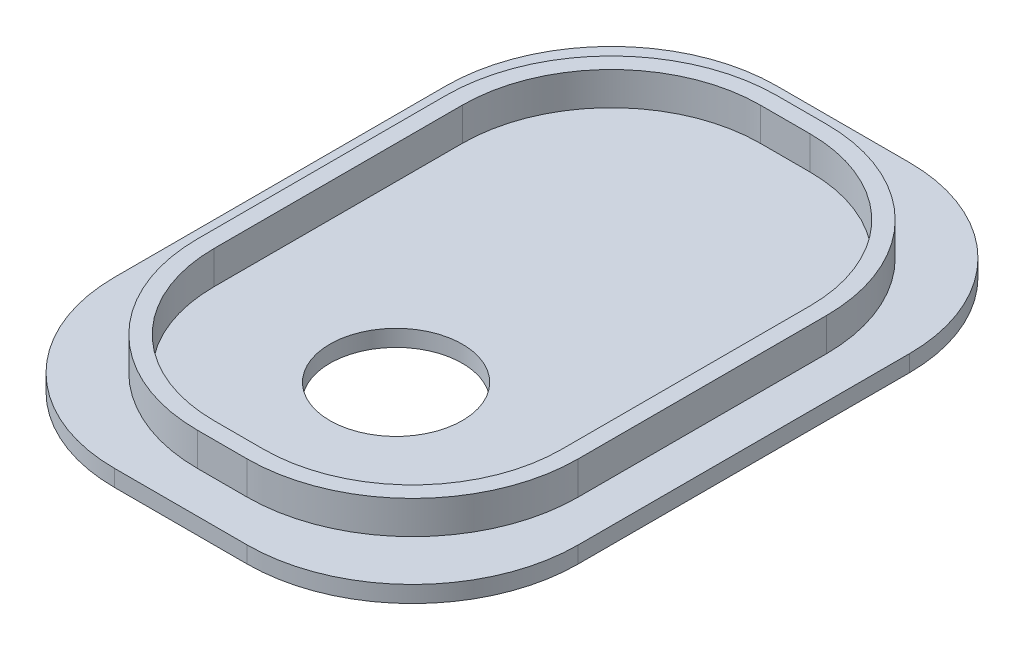
ISO-10303-21;
HEADER;
FILE_DESCRIPTION(('STEP AP214'),'2;1');
FILE_NAME('part.step','',(''),(''),'','','');
FILE_SCHEMA(('AUTOMOTIVE_DESIGN { 1 0 10303 214 1 1 1 1 }'));
ENDSEC;
DATA;
#1=APPLICATION_CONTEXT('core data for automotive mechanical design processes');
#2=APPLICATION_PROTOCOL_DEFINITION('international standard','automotive_design',2000,#1);
#3=PRODUCT_CONTEXT('',#1,'mechanical');
#4=PRODUCT('Part','Part','',(#3));
#5=PRODUCT_RELATED_PRODUCT_CATEGORY('part','',(#4));
#6=PRODUCT_DEFINITION_FORMATION('','',#4);
#7=PRODUCT_DEFINITION_CONTEXT('part definition',#1,'design');
#8=PRODUCT_DEFINITION('design','',#6,#7);
#9=PRODUCT_DEFINITION_SHAPE('','',#8);
#10=(LENGTH_UNIT() NAMED_UNIT(*) SI_UNIT(.MILLI.,.METRE.));
#11=(NAMED_UNIT(*) PLANE_ANGLE_UNIT() SI_UNIT($,.RADIAN.));
#12=(NAMED_UNIT(*) SI_UNIT($,.STERADIAN.) SOLID_ANGLE_UNIT());
#13=UNCERTAINTY_MEASURE_WITH_UNIT(LENGTH_MEASURE(1.E-05),#10,'distance_accuracy_value','');
#14=(GEOMETRIC_REPRESENTATION_CONTEXT(3) GLOBAL_UNCERTAINTY_ASSIGNED_CONTEXT((#13)) GLOBAL_UNIT_ASSIGNED_CONTEXT((#10,
#11,#12)) REPRESENTATION_CONTEXT('',''));
#15=CARTESIAN_POINT('',(0.,0.,0.));
#16=DIRECTION('',(0.,0.,1.));
#17=DIRECTION('',(1.,0.,0.));
#18=AXIS2_PLACEMENT_3D('',#15,#16,#17);
#19=CARTESIAN_POINT('',(-11.5,2.,0.));
#20=DIRECTION('',(1.,0.,0.));
#21=DIRECTION('',(0.,0.,-1.));
#22=AXIS2_PLACEMENT_3D('',#19,#20,#21);
#23=PLANE('',#22);
#24=DIRECTION('',(0.,0.,1.));
#25=VECTOR('',#24,1.);
#26=CARTESIAN_POINT('',(-11.5,0.,0.));
#27=LINE('',#26,#25);
#28=CARTESIAN_POINT('',(-11.5,0.,-14.5));
#29=VERTEX_POINT('',#28);
#30=CARTESIAN_POINT('',(-11.5,0.,0.5));
#31=VERTEX_POINT('',#30);
#32=EDGE_CURVE('E172',#29,#31,#27,.T.);
#33=ORIENTED_EDGE('',*,*,#32,.T.);
#34=DIRECTION('',(0.,-1.,0.));
#35=VECTOR('',#34,1.);
#36=CARTESIAN_POINT('',(-11.5,2.,0.5));
#37=LINE('',#36,#35);
#38=CARTESIAN_POINT('',(-11.5,2.,0.5));
#39=VERTEX_POINT('',#38);
#40=EDGE_CURVE('E11',#39,#31,#37,.T.);
#41=ORIENTED_EDGE('',*,*,#40,.F.);
#42=DIRECTION('',(0.,0.,1.));
#43=VECTOR('',#42,1.);
#44=CARTESIAN_POINT('',(-11.5,2.,0.));
#45=LINE('',#44,#43);
#46=CARTESIAN_POINT('',(-11.5,2.,-14.5));
#47=VERTEX_POINT('',#46);
#48=EDGE_CURVE('E422',#47,#39,#45,.T.);
#49=ORIENTED_EDGE('',*,*,#48,.F.);
#50=DIRECTION('',(0.,-1.,0.));
#51=VECTOR('',#50,1.);
#52=CARTESIAN_POINT('',(-11.5,2.,-14.5));
#53=LINE('',#52,#51);
#54=EDGE_CURVE('E195',#47,#29,#53,.T.);
#55=ORIENTED_EDGE('',*,*,#54,.T.);
#56=EDGE_LOOP('',(#33,#41,#49,#55));
#57=FACE_BOUND('',#56,.T.);
#58=ADVANCED_FACE('F36',(#57),#23,.F.);
#59=CARTESIAN_POINT('',(-1.5,2.,0.5));
#60=DIRECTION('',(0.,-1.,0.));
#61=DIRECTION('',(0.,0.,-1.));
#62=AXIS2_PLACEMENT_3D('',#59,#60,#61);
#63=CYLINDRICAL_SURFACE('',#62,10.);
#64=CARTESIAN_POINT('',(-1.5,0.,0.5));
#65=DIRECTION('',(0.,1.,0.));
#66=DIRECTION('',(0.,0.,1.));
#67=AXIS2_PLACEMENT_3D('',#64,#65,#66);
#68=CIRCLE('',#67,10.);
#69=CARTESIAN_POINT('',(-1.5,0.,10.5));
#70=VERTEX_POINT('',#69);
#71=EDGE_CURVE('E175',#31,#70,#68,.T.);
#72=ORIENTED_EDGE('',*,*,#71,.T.);
#73=DIRECTION('',(0.,-1.,0.));
#74=VECTOR('',#73,1.);
#75=CARTESIAN_POINT('',(-1.5,2.,10.5));
#76=LINE('',#75,#74);
#77=CARTESIAN_POINT('',(-1.5,2.,10.5));
#78=VERTEX_POINT('',#77);
#79=EDGE_CURVE('E46',#78,#70,#76,.T.);
#80=ORIENTED_EDGE('',*,*,#79,.F.);
#81=CARTESIAN_POINT('',(-1.5,2.,0.5));
#82=DIRECTION('',(0.,1.,0.));
#83=DIRECTION('',(0.,0.,1.));
#84=AXIS2_PLACEMENT_3D('',#81,#82,#83);
#85=CIRCLE('',#84,10.);
#86=EDGE_CURVE('E424',#39,#78,#85,.T.);
#87=ORIENTED_EDGE('',*,*,#86,.F.);
#88=ORIENTED_EDGE('',*,*,#40,.T.);
#89=EDGE_LOOP('',(#72,#80,#87,#88));
#90=FACE_BOUND('',#89,.T.);
#91=ADVANCED_FACE('F445',(#90),#63,.T.);
#92=CARTESIAN_POINT('',(0.,2.,10.5));
#93=DIRECTION('',(0.,0.,-1.));
#94=DIRECTION('',(-1.,0.,0.));
#95=AXIS2_PLACEMENT_3D('',#92,#93,#94);
#96=PLANE('',#95);
#97=DIRECTION('',(1.,0.,0.));
#98=VECTOR('',#97,1.);
#99=CARTESIAN_POINT('',(0.,0.,10.5));
#100=LINE('',#99,#98);
#101=CARTESIAN_POINT('',(1.50000000000014,0.,10.5));
#102=VERTEX_POINT('',#101);
#103=EDGE_CURVE('E178',#70,#102,#100,.T.);
#104=ORIENTED_EDGE('',*,*,#103,.T.);
#105=DIRECTION('',(0.,-1.,0.));
#106=VECTOR('',#105,1.);
#107=CARTESIAN_POINT('',(1.50000000000014,2.,10.5));
#108=LINE('',#107,#106);
#109=CARTESIAN_POINT('',(1.50000000000014,2.,10.5));
#110=VERTEX_POINT('',#109);
#111=EDGE_CURVE('E204',#110,#102,#108,.T.);
#112=ORIENTED_EDGE('',*,*,#111,.F.);
#113=DIRECTION('',(1.,0.,0.));
#114=VECTOR('',#113,1.);
#115=CARTESIAN_POINT('',(0.,2.,10.5));
#116=LINE('',#115,#114);
#117=EDGE_CURVE('E426',#78,#110,#116,.T.);
#118=ORIENTED_EDGE('',*,*,#117,.F.);
#119=ORIENTED_EDGE('',*,*,#79,.T.);
#120=EDGE_LOOP('',(#104,#112,#118,#119));
#121=FACE_BOUND('',#120,.T.);
#122=ADVANCED_FACE('F447',(#121),#96,.F.);
#123=CARTESIAN_POINT('',(1.5,2.,0.500000000000001));
#124=DIRECTION('',(0.,-1.,0.));
#125=DIRECTION('',(0.,0.,-1.));
#126=AXIS2_PLACEMENT_3D('',#123,#124,#125);
#127=CYLINDRICAL_SURFACE('',#126,10.);
#128=CARTESIAN_POINT('',(1.5,0.,0.500000000000001));
#129=DIRECTION('',(0.,1.,0.));
#130=DIRECTION('',(0.,0.,1.));
#131=AXIS2_PLACEMENT_3D('',#128,#129,#130);
#132=CIRCLE('',#131,10.);
#133=CARTESIAN_POINT('',(11.5,0.,0.5));
#134=VERTEX_POINT('',#133);
#135=EDGE_CURVE('E181',#102,#134,#132,.T.);
#136=ORIENTED_EDGE('',*,*,#135,.T.);
#137=DIRECTION('',(0.,-1.,0.));
#138=VECTOR('',#137,1.);
#139=CARTESIAN_POINT('',(11.5,2.,0.5));
#140=LINE('',#139,#138);
#141=CARTESIAN_POINT('',(11.5,2.,0.5));
#142=VERTEX_POINT('',#141);
#143=EDGE_CURVE('E201',#142,#134,#140,.T.);
#144=ORIENTED_EDGE('',*,*,#143,.F.);
#145=CARTESIAN_POINT('',(1.5,2.,0.500000000000001));
#146=DIRECTION('',(0.,1.,0.));
#147=DIRECTION('',(0.,0.,1.));
#148=AXIS2_PLACEMENT_3D('',#145,#146,#147);
#149=CIRCLE('',#148,10.);
#150=EDGE_CURVE('E428',#110,#142,#149,.T.);
#151=ORIENTED_EDGE('',*,*,#150,.F.);
#152=ORIENTED_EDGE('',*,*,#111,.T.);
#153=EDGE_LOOP('',(#136,#144,#151,#152));
#154=FACE_BOUND('',#153,.T.);
#155=ADVANCED_FACE('F450',(#154),#127,.T.);
#156=CARTESIAN_POINT('',(11.5,2.,0.));
#157=DIRECTION('',(1.,0.,0.));
#158=DIRECTION('',(0.,0.,-1.));
#159=AXIS2_PLACEMENT_3D('',#156,#157,#158);
#160=PLANE('',#159);
#161=DIRECTION('',(0.,0.,1.));
#162=VECTOR('',#161,1.);
#163=CARTESIAN_POINT('',(11.5,0.,0.));
#164=LINE('',#163,#162);
#165=CARTESIAN_POINT('',(11.5,0.,-14.5));
#166=VERTEX_POINT('',#165);
#167=EDGE_CURVE('E184',#166,#134,#164,.T.);
#168=ORIENTED_EDGE('',*,*,#167,.F.);
#169=DIRECTION('',(0.,-1.,0.));
#170=VECTOR('',#169,1.);
#171=CARTESIAN_POINT('',(11.5,2.,-14.5));
#172=LINE('',#171,#170);
#173=CARTESIAN_POINT('',(11.5,2.,-14.5));
#174=VERTEX_POINT('',#173);
#175=EDGE_CURVE('E142',#174,#166,#172,.T.);
#176=ORIENTED_EDGE('',*,*,#175,.F.);
#177=DIRECTION('',(0.,0.,1.));
#178=VECTOR('',#177,1.);
#179=CARTESIAN_POINT('',(11.5,2.,0.));
#180=LINE('',#179,#178);
#181=EDGE_CURVE('E129',#174,#142,#180,.T.);
#182=ORIENTED_EDGE('',*,*,#181,.T.);
#183=ORIENTED_EDGE('',*,*,#143,.T.);
#184=EDGE_LOOP('',(#168,#176,#182,#183));
#185=FACE_BOUND('',#184,.T.);
#186=ADVANCED_FACE('F431',(#185),#160,.T.);
#187=CARTESIAN_POINT('',(1.5,2.,-14.5));
#188=DIRECTION('',(0.,-1.,0.));
#189=DIRECTION('',(0.,0.,-1.));
#190=AXIS2_PLACEMENT_3D('',#187,#188,#189);
#191=CYLINDRICAL_SURFACE('',#190,10.);
#192=CARTESIAN_POINT('',(1.5,0.,-14.5));
#193=DIRECTION('',(0.,1.,0.));
#194=DIRECTION('',(0.,0.,1.));
#195=AXIS2_PLACEMENT_3D('',#192,#193,#194);
#196=CIRCLE('',#195,10.);
#197=CARTESIAN_POINT('',(1.5,0.,-24.5));
#198=VERTEX_POINT('',#197);
#199=EDGE_CURVE('E139',#166,#198,#196,.T.);
#200=ORIENTED_EDGE('',*,*,#199,.T.);
#201=DIRECTION('',(0.,-1.,0.));
#202=VECTOR('',#201,1.);
#203=CARTESIAN_POINT('',(1.5,2.,-24.5));
#204=LINE('',#203,#202);
#205=CARTESIAN_POINT('',(1.5,2.,-24.5));
#206=VERTEX_POINT('',#205);
#207=EDGE_CURVE('E135',#206,#198,#204,.T.);
#208=ORIENTED_EDGE('',*,*,#207,.F.);
#209=CARTESIAN_POINT('',(1.5,2.,-14.5));
#210=DIRECTION('',(0.,1.,0.));
#211=DIRECTION('',(0.,0.,1.));
#212=AXIS2_PLACEMENT_3D('',#209,#210,#211);
#213=CIRCLE('',#212,10.);
#214=EDGE_CURVE('E123',#174,#206,#213,.T.);
#215=ORIENTED_EDGE('',*,*,#214,.F.);
#216=ORIENTED_EDGE('',*,*,#175,.T.);
#217=EDGE_LOOP('',(#200,#208,#215,#216));
#218=FACE_BOUND('',#217,.T.);
#219=ADVANCED_FACE('F136',(#218),#191,.T.);
#220=CARTESIAN_POINT('',(0.,2.,-24.5));
#221=DIRECTION('',(0.,0.,-1.));
#222=DIRECTION('',(-1.,0.,0.));
#223=AXIS2_PLACEMENT_3D('',#220,#221,#222);
#224=PLANE('',#223);
#225=DIRECTION('',(1.,0.,0.));
#226=VECTOR('',#225,1.);
#227=CARTESIAN_POINT('',(0.,0.,-24.5));
#228=LINE('',#227,#226);
#229=CARTESIAN_POINT('',(-1.5,0.,-24.5));
#230=VERTEX_POINT('',#229);
#231=EDGE_CURVE('E188',#230,#198,#228,.T.);
#232=ORIENTED_EDGE('',*,*,#231,.F.);
#233=DIRECTION('',(0.,-1.,0.));
#234=VECTOR('',#233,1.);
#235=CARTESIAN_POINT('',(-1.5,2.,-24.5));
#236=LINE('',#235,#234);
#237=CARTESIAN_POINT('',(-1.5,2.,-24.5));
#238=VERTEX_POINT('',#237);
#239=EDGE_CURVE('E143',#238,#230,#236,.T.);
#240=ORIENTED_EDGE('',*,*,#239,.F.);
#241=DIRECTION('',(1.,0.,0.));
#242=VECTOR('',#241,1.);
#243=CARTESIAN_POINT('',(0.,2.,-24.5));
#244=LINE('',#243,#242);
#245=EDGE_CURVE('E127',#238,#206,#244,.T.);
#246=ORIENTED_EDGE('',*,*,#245,.T.);
#247=ORIENTED_EDGE('',*,*,#207,.T.);
#248=EDGE_LOOP('',(#232,#240,#246,#247));
#249=FACE_BOUND('',#248,.T.);
#250=ADVANCED_FACE('F145',(#249),#224,.T.);
#251=CARTESIAN_POINT('',(-1.5,2.,-14.5));
#252=DIRECTION('',(0.,-1.,0.));
#253=DIRECTION('',(0.,0.,-1.));
#254=AXIS2_PLACEMENT_3D('',#251,#252,#253);
#255=CYLINDRICAL_SURFACE('',#254,9.);
#256=CARTESIAN_POINT('',(-1.5,0.,-14.5));
#257=DIRECTION('',(0.,1.,0.));
#258=DIRECTION('',(0.,0.,1.));
#259=AXIS2_PLACEMENT_3D('',#256,#257,#258);
#260=CIRCLE('',#259,9.);
#261=CARTESIAN_POINT('',(-1.5,0.,-23.5));
#262=VERTEX_POINT('',#261);
#263=CARTESIAN_POINT('',(-10.5,0.,-14.5));
#264=VERTEX_POINT('',#263);
#265=EDGE_CURVE('E77',#262,#264,#260,.T.);
#266=ORIENTED_EDGE('',*,*,#265,.F.);
#267=DIRECTION('',(0.,-1.,0.));
#268=VECTOR('',#267,1.);
#269=CARTESIAN_POINT('',(-1.5,2.,-23.5));
#270=LINE('',#269,#268);
#271=CARTESIAN_POINT('',(-1.5,2.,-23.5));
#272=VERTEX_POINT('',#271);
#273=EDGE_CURVE('E198',#272,#262,#270,.T.);
#274=ORIENTED_EDGE('',*,*,#273,.F.);
#275=CARTESIAN_POINT('',(-1.5,2.,-14.5));
#276=DIRECTION('',(0.,1.,0.));
#277=DIRECTION('',(0.,0.,1.));
#278=AXIS2_PLACEMENT_3D('',#275,#276,#277);
#279=CIRCLE('',#278,9.);
#280=CARTESIAN_POINT('',(-10.5,2.,-14.5));
#281=VERTEX_POINT('',#280);
#282=EDGE_CURVE('E194',#272,#281,#279,.T.);
#283=ORIENTED_EDGE('',*,*,#282,.T.);
#284=DIRECTION('',(0.,-1.,0.));
#285=VECTOR('',#284,1.);
#286=CARTESIAN_POINT('',(-10.5,2.,-14.5));
#287=LINE('',#286,#285);
#288=EDGE_CURVE('E148',#281,#264,#287,.T.);
#289=ORIENTED_EDGE('',*,*,#288,.T.);
#290=EDGE_LOOP('',(#266,#274,#283,#289));
#291=FACE_BOUND('',#290,.T.);
#292=ADVANCED_FACE('F38',(#291),#255,.F.);
#293=CARTESIAN_POINT('',(0.,2.,-23.5));
#294=DIRECTION('',(0.,0.,-1.));
#295=DIRECTION('',(-1.,0.,0.));
#296=AXIS2_PLACEMENT_3D('',#293,#294,#295);
#297=PLANE('',#296);
#298=DIRECTION('',(1.,0.,0.));
#299=VECTOR('',#298,1.);
#300=CARTESIAN_POINT('',(0.,0.,-23.5));
#301=LINE('',#300,#299);
#302=CARTESIAN_POINT('',(1.5,0.,-23.5));
#303=VERTEX_POINT('',#302);
#304=EDGE_CURVE('E153',#262,#303,#301,.T.);
#305=ORIENTED_EDGE('',*,*,#304,.T.);
#306=DIRECTION('',(0.,-1.,0.));
#307=VECTOR('',#306,1.);
#308=CARTESIAN_POINT('',(1.5,2.,-23.5));
#309=LINE('',#308,#307);
#310=CARTESIAN_POINT('',(1.5,2.,-23.5));
#311=VERTEX_POINT('',#310);
#312=EDGE_CURVE('E225',#311,#303,#309,.T.);
#313=ORIENTED_EDGE('',*,*,#312,.F.);
#314=DIRECTION('',(1.,0.,0.));
#315=VECTOR('',#314,1.);
#316=CARTESIAN_POINT('',(0.,2.,-23.5));
#317=LINE('',#316,#315);
#318=EDGE_CURVE('E232',#272,#311,#317,.T.);
#319=ORIENTED_EDGE('',*,*,#318,.F.);
#320=ORIENTED_EDGE('',*,*,#273,.T.);
#321=EDGE_LOOP('',(#305,#313,#319,#320));
#322=FACE_BOUND('',#321,.T.);
#323=ADVANCED_FACE('F230',(#322),#297,.F.);
#324=CARTESIAN_POINT('',(1.5,2.,-14.5));
#325=DIRECTION('',(0.,-1.,0.));
#326=DIRECTION('',(0.,0.,-1.));
#327=AXIS2_PLACEMENT_3D('',#324,#325,#326);
#328=CYLINDRICAL_SURFACE('',#327,9.);
#329=CARTESIAN_POINT('',(1.5,0.,-14.5));
#330=DIRECTION('',(0.,1.,0.));
#331=DIRECTION('',(0.,0.,1.));
#332=AXIS2_PLACEMENT_3D('',#329,#330,#331);
#333=CIRCLE('',#332,9.);
#334=CARTESIAN_POINT('',(10.5,0.,-14.5));
#335=VERTEX_POINT('',#334);
#336=EDGE_CURVE('E68',#335,#303,#333,.T.);
#337=ORIENTED_EDGE('',*,*,#336,.F.);
#338=DIRECTION('',(0.,-1.,0.));
#339=VECTOR('',#338,1.);
#340=CARTESIAN_POINT('',(10.5,2.,-14.5));
#341=LINE('',#340,#339);
#342=CARTESIAN_POINT('',(10.5,2.,-14.5));
#343=VERTEX_POINT('',#342);
#344=EDGE_CURVE('E222',#343,#335,#341,.T.);
#345=ORIENTED_EDGE('',*,*,#344,.F.);
#346=CARTESIAN_POINT('',(1.5,2.,-14.5));
#347=DIRECTION('',(0.,1.,0.));
#348=DIRECTION('',(0.,0.,1.));
#349=AXIS2_PLACEMENT_3D('',#346,#347,#348);
#350=CIRCLE('',#349,9.);
#351=EDGE_CURVE('E411',#343,#311,#350,.T.);
#352=ORIENTED_EDGE('',*,*,#351,.T.);
#353=ORIENTED_EDGE('',*,*,#312,.T.);
#354=EDGE_LOOP('',(#337,#345,#352,#353));
#355=FACE_BOUND('',#354,.T.);
#356=ADVANCED_FACE('F477',(#355),#328,.F.);
#357=CARTESIAN_POINT('',(10.5,2.,0.));
#358=DIRECTION('',(1.,0.,0.));
#359=DIRECTION('',(0.,0.,-1.));
#360=AXIS2_PLACEMENT_3D('',#357,#358,#359);
#361=PLANE('',#360);
#362=DIRECTION('',(0.,0.,1.));
#363=VECTOR('',#362,1.);
#364=CARTESIAN_POINT('',(10.5,0.,0.));
#365=LINE('',#364,#363);
#366=CARTESIAN_POINT('',(10.5,0.,0.500000000000003));
#367=VERTEX_POINT('',#366);
#368=EDGE_CURVE('E158',#335,#367,#365,.T.);
#369=ORIENTED_EDGE('',*,*,#368,.T.);
#370=DIRECTION('',(0.,-1.,0.));
#371=VECTOR('',#370,1.);
#372=CARTESIAN_POINT('',(10.5,2.,0.500000000000003));
#373=LINE('',#372,#371);
#374=CARTESIAN_POINT('',(10.5,2.,0.500000000000003));
#375=VERTEX_POINT('',#374);
#376=EDGE_CURVE('E219',#375,#367,#373,.T.);
#377=ORIENTED_EDGE('',*,*,#376,.F.);
#378=DIRECTION('',(0.,0.,1.));
#379=VECTOR('',#378,1.);
#380=CARTESIAN_POINT('',(10.5,2.,0.));
#381=LINE('',#380,#379);
#382=EDGE_CURVE('E414',#343,#375,#381,.T.);
#383=ORIENTED_EDGE('',*,*,#382,.F.);
#384=ORIENTED_EDGE('',*,*,#344,.T.);
#385=EDGE_LOOP('',(#369,#377,#383,#384));
#386=FACE_BOUND('',#385,.T.);
#387=ADVANCED_FACE('F474',(#386),#361,.F.);
#388=CARTESIAN_POINT('',(1.5,2.,0.500000000000001));
#389=DIRECTION('',(0.,-1.,0.));
#390=DIRECTION('',(0.,0.,-1.));
#391=AXIS2_PLACEMENT_3D('',#388,#389,#390);
#392=CYLINDRICAL_SURFACE('',#391,9.);
#393=CARTESIAN_POINT('',(1.5,0.,0.500000000000001));
#394=DIRECTION('',(0.,1.,0.));
#395=DIRECTION('',(0.,0.,1.));
#396=AXIS2_PLACEMENT_3D('',#393,#394,#395);
#397=CIRCLE('',#396,9.);
#398=CARTESIAN_POINT('',(1.50000000000014,0.,9.5));
#399=VERTEX_POINT('',#398);
#400=EDGE_CURVE('E161',#399,#367,#397,.T.);
#401=ORIENTED_EDGE('',*,*,#400,.F.);
#402=DIRECTION('',(0.,-1.,0.));
#403=VECTOR('',#402,1.);
#404=CARTESIAN_POINT('',(1.50000000000014,2.,9.5));
#405=LINE('',#404,#403);
#406=CARTESIAN_POINT('',(1.50000000000014,2.,9.5));
#407=VERTEX_POINT('',#406);
#408=EDGE_CURVE('E216',#407,#399,#405,.T.);
#409=ORIENTED_EDGE('',*,*,#408,.F.);
#410=CARTESIAN_POINT('',(1.5,2.,0.500000000000001));
#411=DIRECTION('',(0.,1.,0.));
#412=DIRECTION('',(0.,0.,1.));
#413=AXIS2_PLACEMENT_3D('',#410,#411,#412);
#414=CIRCLE('',#413,9.);
#415=EDGE_CURVE('E416',#407,#375,#414,.T.);
#416=ORIENTED_EDGE('',*,*,#415,.T.);
#417=ORIENTED_EDGE('',*,*,#376,.T.);
#418=EDGE_LOOP('',(#401,#409,#416,#417));
#419=FACE_BOUND('',#418,.T.);
#420=ADVANCED_FACE('F264',(#419),#392,.F.);
#421=CARTESIAN_POINT('',(0.,2.,9.5));
#422=DIRECTION('',(0.,0.,-1.));
#423=DIRECTION('',(-1.,0.,0.));
#424=AXIS2_PLACEMENT_3D('',#421,#422,#423);
#425=PLANE('',#424);
#426=DIRECTION('',(1.,0.,0.));
#427=VECTOR('',#426,1.);
#428=CARTESIAN_POINT('',(0.,0.,9.5));
#429=LINE('',#428,#427);
#430=CARTESIAN_POINT('',(-1.5,0.,9.5));
#431=VERTEX_POINT('',#430);
#432=EDGE_CURVE('E164',#431,#399,#429,.T.);
#433=ORIENTED_EDGE('',*,*,#432,.F.);
#434=DIRECTION('',(0.,-1.,0.));
#435=VECTOR('',#434,1.);
#436=CARTESIAN_POINT('',(-1.5,2.,9.5));
#437=LINE('',#436,#435);
#438=CARTESIAN_POINT('',(-1.5,2.,9.5));
#439=VERTEX_POINT('',#438);
#440=EDGE_CURVE('E213',#439,#431,#437,.T.);
#441=ORIENTED_EDGE('',*,*,#440,.F.);
#442=DIRECTION('',(1.,0.,0.));
#443=VECTOR('',#442,1.);
#444=CARTESIAN_POINT('',(0.,2.,9.5));
#445=LINE('',#444,#443);
#446=EDGE_CURVE('E258',#439,#407,#445,.T.);
#447=ORIENTED_EDGE('',*,*,#446,.T.);
#448=ORIENTED_EDGE('',*,*,#408,.T.);
#449=EDGE_LOOP('',(#433,#441,#447,#448));
#450=FACE_BOUND('',#449,.T.);
#451=ADVANCED_FACE('F256',(#450),#425,.T.);
#452=CARTESIAN_POINT('',(-1.5,2.,0.5));
#453=DIRECTION('',(0.,-1.,0.));
#454=DIRECTION('',(0.,0.,-1.));
#455=AXIS2_PLACEMENT_3D('',#452,#453,#454);
#456=CYLINDRICAL_SURFACE('',#455,9.);
#457=CARTESIAN_POINT('',(-1.5,0.,0.5));
#458=DIRECTION('',(0.,1.,0.));
#459=DIRECTION('',(0.,0.,1.));
#460=AXIS2_PLACEMENT_3D('',#457,#458,#459);
#461=CIRCLE('',#460,9.);
#462=CARTESIAN_POINT('',(-10.5,0.,0.5));
#463=VERTEX_POINT('',#462);
#464=EDGE_CURVE('E167',#463,#431,#461,.T.);
#465=ORIENTED_EDGE('',*,*,#464,.F.);
#466=DIRECTION('',(0.,-1.,0.));
#467=VECTOR('',#466,1.);
#468=CARTESIAN_POINT('',(-10.5,2.,0.5));
#469=LINE('',#468,#467);
#470=CARTESIAN_POINT('',(-10.5,2.,0.5));
#471=VERTEX_POINT('',#470);
#472=EDGE_CURVE('E210',#471,#463,#469,.T.);
#473=ORIENTED_EDGE('',*,*,#472,.F.);
#474=CARTESIAN_POINT('',(-1.5,2.,0.5));
#475=DIRECTION('',(0.,1.,0.));
#476=DIRECTION('',(0.,0.,1.));
#477=AXIS2_PLACEMENT_3D('',#474,#475,#476);
#478=CIRCLE('',#477,9.);
#479=EDGE_CURVE('E252',#471,#439,#478,.T.);
#480=ORIENTED_EDGE('',*,*,#479,.T.);
#481=ORIENTED_EDGE('',*,*,#440,.T.);
#482=EDGE_LOOP('',(#465,#473,#480,#481));
#483=FACE_BOUND('',#482,.T.);
#484=ADVANCED_FACE('F250',(#483),#456,.F.);
#485=CARTESIAN_POINT('',(-10.5,2.,0.));
#486=DIRECTION('',(1.,0.,0.));
#487=DIRECTION('',(0.,0.,-1.));
#488=AXIS2_PLACEMENT_3D('',#485,#486,#487);
#489=PLANE('',#488);
#490=DIRECTION('',(0.,0.,1.));
#491=VECTOR('',#490,1.);
#492=CARTESIAN_POINT('',(-10.5,0.,0.));
#493=LINE('',#492,#491);
#494=EDGE_CURVE('E170',#264,#463,#493,.T.);
#495=ORIENTED_EDGE('',*,*,#494,.F.);
#496=ORIENTED_EDGE('',*,*,#288,.F.);
#497=DIRECTION('',(0.,0.,1.));
#498=VECTOR('',#497,1.);
#499=CARTESIAN_POINT('',(-10.5,2.,0.));
#500=LINE('',#499,#498);
#501=EDGE_CURVE('E420',#281,#471,#500,.T.);
#502=ORIENTED_EDGE('',*,*,#501,.T.);
#503=ORIENTED_EDGE('',*,*,#472,.T.);
#504=EDGE_LOOP('',(#495,#496,#502,#503));
#505=FACE_BOUND('',#504,.T.);
#506=ADVANCED_FACE('F243',(#505),#489,.T.);
#507=CARTESIAN_POINT('',(-1.5,2.,-14.5));
#508=DIRECTION('',(0.,-1.,0.));
#509=DIRECTION('',(0.,0.,-1.));
#510=AXIS2_PLACEMENT_3D('',#507,#508,#509);
#511=CYLINDRICAL_SURFACE('',#510,10.);
#512=CARTESIAN_POINT('',(-1.5,0.,-14.5));
#513=DIRECTION('',(0.,1.,0.));
#514=DIRECTION('',(0.,0.,1.));
#515=AXIS2_PLACEMENT_3D('',#512,#513,#514);
#516=CIRCLE('',#515,10.);
#517=EDGE_CURVE('E191',#230,#29,#516,.T.);
#518=ORIENTED_EDGE('',*,*,#517,.T.);
#519=ORIENTED_EDGE('',*,*,#54,.F.);
#520=CARTESIAN_POINT('',(-1.5,2.,-14.5));
#521=DIRECTION('',(0.,1.,0.));
#522=DIRECTION('',(0.,0.,1.));
#523=AXIS2_PLACEMENT_3D('',#520,#521,#522);
#524=CIRCLE('',#523,10.);
#525=EDGE_CURVE('E55',#238,#47,#524,.T.);
#526=ORIENTED_EDGE('',*,*,#525,.F.);
#527=ORIENTED_EDGE('',*,*,#239,.T.);
#528=EDGE_LOOP('',(#518,#519,#526,#527));
#529=FACE_BOUND('',#528,.T.);
#530=ADVANCED_FACE('F437',(#529),#511,.T.);
#531=CARTESIAN_POINT('',(0.,2.,0.));
#532=DIRECTION('',(0.,1.,0.));
#533=DIRECTION('',(0.,0.,1.));
#534=AXIS2_PLACEMENT_3D('',#531,#532,#533);
#535=PLANE('',#534);
#536=ORIENTED_EDGE('',*,*,#282,.F.);
#537=ORIENTED_EDGE('',*,*,#318,.T.);
#538=ORIENTED_EDGE('',*,*,#351,.F.);
#539=ORIENTED_EDGE('',*,*,#382,.T.);
#540=ORIENTED_EDGE('',*,*,#415,.F.);
#541=ORIENTED_EDGE('',*,*,#446,.F.);
#542=ORIENTED_EDGE('',*,*,#479,.F.);
#543=ORIENTED_EDGE('',*,*,#501,.F.);
#544=EDGE_LOOP('',(#536,#537,#538,#539,#540,#541,#542,#543));
#545=FACE_BOUND('',#544,.T.);
#546=ORIENTED_EDGE('',*,*,#48,.T.);
#547=ORIENTED_EDGE('',*,*,#86,.T.);
#548=ORIENTED_EDGE('',*,*,#117,.T.);
#549=ORIENTED_EDGE('',*,*,#150,.T.);
#550=ORIENTED_EDGE('',*,*,#181,.F.);
#551=ORIENTED_EDGE('',*,*,#214,.T.);
#552=ORIENTED_EDGE('',*,*,#245,.F.);
#553=ORIENTED_EDGE('',*,*,#525,.T.);
#554=EDGE_LOOP('',(#546,#547,#548,#549,#550,#551,#552,#553));
#555=FACE_BOUND('',#554,.T.);
#556=ADVANCED_FACE('F125',(#545,#555),#535,.T.);
#557=CARTESIAN_POINT('',(0.,0.,0.));
#558=DIRECTION('',(0.,1.,0.));
#559=DIRECTION('',(0.,0.,1.));
#560=AXIS2_PLACEMENT_3D('',#557,#558,#559);
#561=PLANE('',#560);
#562=ORIENTED_EDGE('',*,*,#32,.F.);
#563=ORIENTED_EDGE('',*,*,#517,.F.);
#564=ORIENTED_EDGE('',*,*,#231,.T.);
#565=ORIENTED_EDGE('',*,*,#199,.F.);
#566=ORIENTED_EDGE('',*,*,#167,.T.);
#567=ORIENTED_EDGE('',*,*,#135,.F.);
#568=ORIENTED_EDGE('',*,*,#103,.F.);
#569=ORIENTED_EDGE('',*,*,#71,.F.);
#570=EDGE_LOOP('',(#562,#563,#564,#565,#566,#567,#568,#569));
#571=FACE_BOUND('',#570,.T.);
#572=DIRECTION('',(0.,0.,-1.));
#573=VECTOR('',#572,1.);
#574=CARTESIAN_POINT('',(14.,0.,0.));
#575=LINE('',#574,#573);
#576=CARTESIAN_POINT('',(14.,0.,2.99999999999986));
#577=VERTEX_POINT('',#576);
#578=CARTESIAN_POINT('',(14.,0.,-17.));
#579=VERTEX_POINT('',#578);
#580=EDGE_CURVE('E380',#577,#579,#575,.T.);
#581=ORIENTED_EDGE('',*,*,#580,.T.);
#582=CARTESIAN_POINT('',(4.,0.,-17.));
#583=DIRECTION('',(0.,1.,0.));
#584=DIRECTION('',(0.,0.,1.));
#585=AXIS2_PLACEMENT_3D('',#582,#583,#584);
#586=CIRCLE('',#585,10.);
#587=CARTESIAN_POINT('',(4.,0.,-27.));
#588=VERTEX_POINT('',#587);
#589=EDGE_CURVE('E340',#579,#588,#586,.T.);
#590=ORIENTED_EDGE('',*,*,#589,.T.);
#591=DIRECTION('',(-1.,0.,0.));
#592=VECTOR('',#591,1.);
#593=CARTESIAN_POINT('',(0.,0.,-27.));
#594=LINE('',#593,#592);
#595=CARTESIAN_POINT('',(-4.,0.,-27.));
#596=VERTEX_POINT('',#595);
#597=EDGE_CURVE('E383',#588,#596,#594,.T.);
#598=ORIENTED_EDGE('',*,*,#597,.T.);
#599=CARTESIAN_POINT('',(-4.,0.,-17.));
#600=DIRECTION('',(0.,1.,0.));
#601=DIRECTION('',(0.,0.,1.));
#602=AXIS2_PLACEMENT_3D('',#599,#600,#601);
#603=CIRCLE('',#602,10.);
#604=CARTESIAN_POINT('',(-14.,0.,-17.));
#605=VERTEX_POINT('',#604);
#606=EDGE_CURVE('E386',#596,#605,#603,.T.);
#607=ORIENTED_EDGE('',*,*,#606,.T.);
#608=DIRECTION('',(0.,0.,-1.));
#609=VECTOR('',#608,1.);
#610=CARTESIAN_POINT('',(-14.,0.,0.));
#611=LINE('',#610,#609);
#612=CARTESIAN_POINT('',(-14.,0.,3.));
#613=VERTEX_POINT('',#612);
#614=EDGE_CURVE('E389',#613,#605,#611,.T.);
#615=ORIENTED_EDGE('',*,*,#614,.F.);
#616=CARTESIAN_POINT('',(-4.,0.,3.));
#617=DIRECTION('',(0.,1.,0.));
#618=DIRECTION('',(0.,0.,1.));
#619=AXIS2_PLACEMENT_3D('',#616,#617,#618);
#620=CIRCLE('',#619,10.);
#621=CARTESIAN_POINT('',(-4.,0.,13.));
#622=VERTEX_POINT('',#621);
#623=EDGE_CURVE('E392',#613,#622,#620,.T.);
#624=ORIENTED_EDGE('',*,*,#623,.T.);
#625=DIRECTION('',(-1.,0.,0.));
#626=VECTOR('',#625,1.);
#627=CARTESIAN_POINT('',(0.,0.,13.));
#628=LINE('',#627,#626);
#629=CARTESIAN_POINT('',(4.,0.,13.));
#630=VERTEX_POINT('',#629);
#631=EDGE_CURVE('E363',#630,#622,#628,.T.);
#632=ORIENTED_EDGE('',*,*,#631,.F.);
#633=CARTESIAN_POINT('',(4.,0.,2.99999999999999));
#634=DIRECTION('',(0.,1.,0.));
#635=DIRECTION('',(0.,0.,1.));
#636=AXIS2_PLACEMENT_3D('',#633,#634,#635);
#637=CIRCLE('',#636,10.);
#638=EDGE_CURVE('E360',#630,#577,#637,.T.);
#639=ORIENTED_EDGE('',*,*,#638,.T.);
#640=EDGE_LOOP('',(#581,#590,#598,#607,#615,#624,#632,#639));
#641=FACE_BOUND('',#640,.T.);
#642=ADVANCED_FACE('F434',(#571,#641),#561,.T.);
#643=CARTESIAN_POINT('',(0.,-1.,0.));
#644=DIRECTION('',(0.,1.,0.));
#645=DIRECTION('',(0.,0.,1.));
#646=AXIS2_PLACEMENT_3D('',#643,#644,#645);
#647=PLANE('',#646);
#648=CARTESIAN_POINT('',(0.,-1.,0.));
#649=DIRECTION('',(0.,1.,0.));
#650=DIRECTION('',(0.,0.,1.));
#651=AXIS2_PLACEMENT_3D('',#648,#649,#650);
#652=CIRCLE('',#651,4.);
#653=CARTESIAN_POINT('',(0.,-1.,4.));
#654=VERTEX_POINT('',#653);
#655=EDGE_CURVE('E366',#654,#654,#652,.T.);
#656=ORIENTED_EDGE('',*,*,#655,.T.);
#657=EDGE_LOOP('',(#656));
#658=FACE_BOUND('',#657,.T.);
#659=DIRECTION('',(0.,0.,-1.));
#660=VECTOR('',#659,1.);
#661=CARTESIAN_POINT('',(14.,-1.,0.));
#662=LINE('',#661,#660);
#663=CARTESIAN_POINT('',(14.,-1.,2.99999999999986));
#664=VERTEX_POINT('',#663);
#665=CARTESIAN_POINT('',(14.,-1.,-17.));
#666=VERTEX_POINT('',#665);
#667=EDGE_CURVE('E353',#664,#666,#662,.T.);
#668=ORIENTED_EDGE('',*,*,#667,.F.);
#669=CARTESIAN_POINT('',(4.,-1.,2.99999999999999));
#670=DIRECTION('',(0.,1.,0.));
#671=DIRECTION('',(0.,0.,1.));
#672=AXIS2_PLACEMENT_3D('',#669,#670,#671);
#673=CIRCLE('',#672,10.);
#674=CARTESIAN_POINT('',(4.,-1.,13.));
#675=VERTEX_POINT('',#674);
#676=EDGE_CURVE('E346',#675,#664,#673,.T.);
#677=ORIENTED_EDGE('',*,*,#676,.F.);
#678=DIRECTION('',(-1.,0.,0.));
#679=VECTOR('',#678,1.);
#680=CARTESIAN_POINT('',(0.,-1.,13.));
#681=LINE('',#680,#679);
#682=CARTESIAN_POINT('',(-4.,-1.,13.));
#683=VERTEX_POINT('',#682);
#684=EDGE_CURVE('E377',#675,#683,#681,.T.);
#685=ORIENTED_EDGE('',*,*,#684,.T.);
#686=CARTESIAN_POINT('',(-4.,-1.,3.));
#687=DIRECTION('',(0.,1.,0.));
#688=DIRECTION('',(0.,0.,1.));
#689=AXIS2_PLACEMENT_3D('',#686,#687,#688);
#690=CIRCLE('',#689,10.);
#691=CARTESIAN_POINT('',(-14.,-1.,3.));
#692=VERTEX_POINT('',#691);
#693=EDGE_CURVE('E374',#692,#683,#690,.T.);
#694=ORIENTED_EDGE('',*,*,#693,.F.);
#695=DIRECTION('',(0.,0.,-1.));
#696=VECTOR('',#695,1.);
#697=CARTESIAN_POINT('',(-14.,-1.,0.));
#698=LINE('',#697,#696);
#699=CARTESIAN_POINT('',(-14.,-1.,-17.));
#700=VERTEX_POINT('',#699);
#701=EDGE_CURVE('E372',#692,#700,#698,.T.);
#702=ORIENTED_EDGE('',*,*,#701,.T.);
#703=CARTESIAN_POINT('',(-4.,-1.,-17.));
#704=DIRECTION('',(0.,1.,0.));
#705=DIRECTION('',(0.,0.,1.));
#706=AXIS2_PLACEMENT_3D('',#703,#704,#705);
#707=CIRCLE('',#706,10.);
#708=CARTESIAN_POINT('',(-4.,-1.,-27.));
#709=VERTEX_POINT('',#708);
#710=EDGE_CURVE('E369',#709,#700,#707,.T.);
#711=ORIENTED_EDGE('',*,*,#710,.F.);
#712=DIRECTION('',(-1.,0.,0.));
#713=VECTOR('',#712,1.);
#714=CARTESIAN_POINT('',(0.,-1.,-27.));
#715=LINE('',#714,#713);
#716=CARTESIAN_POINT('',(4.,-1.,-27.));
#717=VERTEX_POINT('',#716);
#718=EDGE_CURVE('E357',#717,#709,#715,.T.);
#719=ORIENTED_EDGE('',*,*,#718,.F.);
#720=CARTESIAN_POINT('',(4.,-1.,-17.));
#721=DIRECTION('',(0.,1.,0.));
#722=DIRECTION('',(0.,0.,1.));
#723=AXIS2_PLACEMENT_3D('',#720,#721,#722);
#724=CIRCLE('',#723,10.);
#725=EDGE_CURVE('E338',#666,#717,#724,.T.);
#726=ORIENTED_EDGE('',*,*,#725,.F.);
#727=EDGE_LOOP('',(#668,#677,#685,#694,#702,#711,#719,#726));
#728=FACE_BOUND('',#727,.T.);
#729=ADVANCED_FACE('F351',(#658,#728),#647,.F.);
#730=CARTESIAN_POINT('',(4.,-1.,-17.));
#731=DIRECTION('',(0.,1.,0.));
#732=DIRECTION('',(0.,0.,1.));
#733=AXIS2_PLACEMENT_3D('',#730,#731,#732);
#734=CYLINDRICAL_SURFACE('',#733,10.);
#735=ORIENTED_EDGE('',*,*,#589,.F.);
#736=DIRECTION('',(0.,1.,0.));
#737=VECTOR('',#736,1.);
#738=CARTESIAN_POINT('',(14.,-1.,-17.));
#739=LINE('',#738,#737);
#740=EDGE_CURVE('E335',#666,#579,#739,.T.);
#741=ORIENTED_EDGE('',*,*,#740,.F.);
#742=ORIENTED_EDGE('',*,*,#725,.T.);
#743=DIRECTION('',(0.,1.,0.));
#744=VECTOR('',#743,1.);
#745=CARTESIAN_POINT('',(4.,-1.,-27.));
#746=LINE('',#745,#744);
#747=EDGE_CURVE('E345',#717,#588,#746,.T.);
#748=ORIENTED_EDGE('',*,*,#747,.T.);
#749=EDGE_LOOP('',(#735,#741,#742,#748));
#750=FACE_BOUND('',#749,.T.);
#751=ADVANCED_FACE('F337',(#750),#734,.T.);
#752=CARTESIAN_POINT('',(0.,-1.,-27.));
#753=DIRECTION('',(0.,0.,-1.));
#754=DIRECTION('',(-1.,0.,0.));
#755=AXIS2_PLACEMENT_3D('',#752,#753,#754);
#756=PLANE('',#755);
#757=ORIENTED_EDGE('',*,*,#597,.F.);
#758=ORIENTED_EDGE('',*,*,#747,.F.);
#759=ORIENTED_EDGE('',*,*,#718,.T.);
#760=DIRECTION('',(0.,1.,0.));
#761=VECTOR('',#760,1.);
#762=CARTESIAN_POINT('',(-4.,-1.,-27.));
#763=LINE('',#762,#761);
#764=EDGE_CURVE('E406',#709,#596,#763,.T.);
#765=ORIENTED_EDGE('',*,*,#764,.T.);
#766=EDGE_LOOP('',(#757,#758,#759,#765));
#767=FACE_BOUND('',#766,.T.);
#768=ADVANCED_FACE('F504',(#767),#756,.T.);
#769=CARTESIAN_POINT('',(-4.,-1.,-17.));
#770=DIRECTION('',(0.,1.,0.));
#771=DIRECTION('',(0.,0.,1.));
#772=AXIS2_PLACEMENT_3D('',#769,#770,#771);
#773=CYLINDRICAL_SURFACE('',#772,10.);
#774=ORIENTED_EDGE('',*,*,#606,.F.);
#775=ORIENTED_EDGE('',*,*,#764,.F.);
#776=ORIENTED_EDGE('',*,*,#710,.T.);
#777=DIRECTION('',(0.,1.,0.));
#778=VECTOR('',#777,1.);
#779=CARTESIAN_POINT('',(-14.,-1.,-17.));
#780=LINE('',#779,#778);
#781=EDGE_CURVE('E404',#700,#605,#780,.T.);
#782=ORIENTED_EDGE('',*,*,#781,.T.);
#783=EDGE_LOOP('',(#774,#775,#776,#782));
#784=FACE_BOUND('',#783,.T.);
#785=ADVANCED_FACE('F507',(#784),#773,.T.);
#786=CARTESIAN_POINT('',(-14.,-1.,0.));
#787=DIRECTION('',(1.,0.,0.));
#788=DIRECTION('',(0.,0.,-1.));
#789=AXIS2_PLACEMENT_3D('',#786,#787,#788);
#790=PLANE('',#789);
#791=ORIENTED_EDGE('',*,*,#614,.T.);
#792=ORIENTED_EDGE('',*,*,#781,.F.);
#793=ORIENTED_EDGE('',*,*,#701,.F.);
#794=DIRECTION('',(0.,1.,0.));
#795=VECTOR('',#794,1.);
#796=CARTESIAN_POINT('',(-14.,-1.,3.));
#797=LINE('',#796,#795);
#798=EDGE_CURVE('E402',#692,#613,#797,.T.);
#799=ORIENTED_EDGE('',*,*,#798,.T.);
#800=EDGE_LOOP('',(#791,#792,#793,#799));
#801=FACE_BOUND('',#800,.T.);
#802=ADVANCED_FACE('F511',(#801),#790,.F.);
#803=CARTESIAN_POINT('',(-4.,-1.,3.));
#804=DIRECTION('',(0.,1.,0.));
#805=DIRECTION('',(0.,0.,1.));
#806=AXIS2_PLACEMENT_3D('',#803,#804,#805);
#807=CYLINDRICAL_SURFACE('',#806,10.);
#808=ORIENTED_EDGE('',*,*,#623,.F.);
#809=ORIENTED_EDGE('',*,*,#798,.F.);
#810=ORIENTED_EDGE('',*,*,#693,.T.);
#811=DIRECTION('',(0.,1.,0.));
#812=VECTOR('',#811,1.);
#813=CARTESIAN_POINT('',(-4.,-1.,13.));
#814=LINE('',#813,#812);
#815=EDGE_CURVE('E400',#683,#622,#814,.T.);
#816=ORIENTED_EDGE('',*,*,#815,.T.);
#817=EDGE_LOOP('',(#808,#809,#810,#816));
#818=FACE_BOUND('',#817,.T.);
#819=ADVANCED_FACE('F515',(#818),#807,.T.);
#820=CARTESIAN_POINT('',(0.,-1.,13.));
#821=DIRECTION('',(0.,0.,-1.));
#822=DIRECTION('',(-1.,0.,0.));
#823=AXIS2_PLACEMENT_3D('',#820,#821,#822);
#824=PLANE('',#823);
#825=ORIENTED_EDGE('',*,*,#631,.T.);
#826=ORIENTED_EDGE('',*,*,#815,.F.);
#827=ORIENTED_EDGE('',*,*,#684,.F.);
#828=DIRECTION('',(0.,1.,0.));
#829=VECTOR('',#828,1.);
#830=CARTESIAN_POINT('',(4.,-1.,13.));
#831=LINE('',#830,#829);
#832=EDGE_CURVE('E398',#675,#630,#831,.T.);
#833=ORIENTED_EDGE('',*,*,#832,.T.);
#834=EDGE_LOOP('',(#825,#826,#827,#833));
#835=FACE_BOUND('',#834,.T.);
#836=ADVANCED_FACE('F519',(#835),#824,.F.);
#837=CARTESIAN_POINT('',(4.,-1.,2.99999999999999));
#838=DIRECTION('',(0.,1.,0.));
#839=DIRECTION('',(0.,0.,1.));
#840=AXIS2_PLACEMENT_3D('',#837,#838,#839);
#841=CYLINDRICAL_SURFACE('',#840,10.);
#842=ORIENTED_EDGE('',*,*,#638,.F.);
#843=ORIENTED_EDGE('',*,*,#832,.F.);
#844=ORIENTED_EDGE('',*,*,#676,.T.);
#845=DIRECTION('',(0.,1.,0.));
#846=VECTOR('',#845,1.);
#847=CARTESIAN_POINT('',(14.,-1.,2.99999999999986));
#848=LINE('',#847,#846);
#849=EDGE_CURVE('E154',#664,#577,#848,.T.);
#850=ORIENTED_EDGE('',*,*,#849,.T.);
#851=EDGE_LOOP('',(#842,#843,#844,#850));
#852=FACE_BOUND('',#851,.T.);
#853=ADVANCED_FACE('F501',(#852),#841,.T.);
#854=CARTESIAN_POINT('',(14.,-1.,0.));
#855=DIRECTION('',(1.,0.,0.));
#856=DIRECTION('',(0.,0.,-1.));
#857=AXIS2_PLACEMENT_3D('',#854,#855,#856);
#858=PLANE('',#857);
#859=ORIENTED_EDGE('',*,*,#580,.F.);
#860=ORIENTED_EDGE('',*,*,#849,.F.);
#861=ORIENTED_EDGE('',*,*,#667,.T.);
#862=ORIENTED_EDGE('',*,*,#740,.T.);
#863=EDGE_LOOP('',(#859,#860,#861,#862));
#864=FACE_BOUND('',#863,.T.);
#865=ADVANCED_FACE('F359',(#864),#858,.T.);
#866=CARTESIAN_POINT('',(0.,0.,0.));
#867=DIRECTION('',(0.,1.,0.));
#868=DIRECTION('',(0.,0.,1.));
#869=AXIS2_PLACEMENT_3D('',#866,#867,#868);
#870=CIRCLE('',#869,4.);
#871=CARTESIAN_POINT('',(0.,0.,4.));
#872=VERTEX_POINT('',#871);
#873=EDGE_CURVE('E40',#872,#872,#870,.T.);
#874=ORIENTED_EDGE('',*,*,#873,.F.);
#875=EDGE_LOOP('',(#874));
#876=FACE_BOUND('',#875,.T.);
#877=ORIENTED_EDGE('',*,*,#304,.F.);
#878=ORIENTED_EDGE('',*,*,#265,.T.);
#879=ORIENTED_EDGE('',*,*,#494,.T.);
#880=ORIENTED_EDGE('',*,*,#464,.T.);
#881=ORIENTED_EDGE('',*,*,#432,.T.);
#882=ORIENTED_EDGE('',*,*,#400,.T.);
#883=ORIENTED_EDGE('',*,*,#368,.F.);
#884=ORIENTED_EDGE('',*,*,#336,.T.);
#885=EDGE_LOOP('',(#877,#878,#879,#880,#881,#882,#883,#884));
#886=FACE_BOUND('',#885,.T.);
#887=ADVANCED_FACE('F245',(#876,#886),#561,.T.);
#888=CARTESIAN_POINT('',(0.,-1.,0.));
#889=DIRECTION('',(0.,1.,0.));
#890=DIRECTION('',(0.,0.,1.));
#891=AXIS2_PLACEMENT_3D('',#888,#889,#890);
#892=CYLINDRICAL_SURFACE('',#891,4.);
#893=ORIENTED_EDGE('',*,*,#873,.T.);
#894=EDGE_LOOP('',(#893));
#895=FACE_BOUND('',#894,.T.);
#896=ORIENTED_EDGE('',*,*,#655,.F.);
#897=EDGE_LOOP('',(#896));
#898=FACE_BOUND('',#897,.T.);
#899=ADVANCED_FACE('F532',(#895,#898),#892,.F.);
#900=CLOSED_SHELL('',(#58,#91,#122,#155,#186,#219,#250,#292,#323,#356,#387,#420,#451,#484,#506,
#530,#556,#642,#729,#751,#768,#785,#802,#819,#836,#853,#865,#887,#899));
#901=MANIFOLD_SOLID_BREP('B2',#900);
#902=ADVANCED_BREP_SHAPE_REPRESENTATION('',(#18,#901),#14);
#903=SHAPE_DEFINITION_REPRESENTATION(#9,#902);
ENDSEC;
END-ISO-10303-21;
